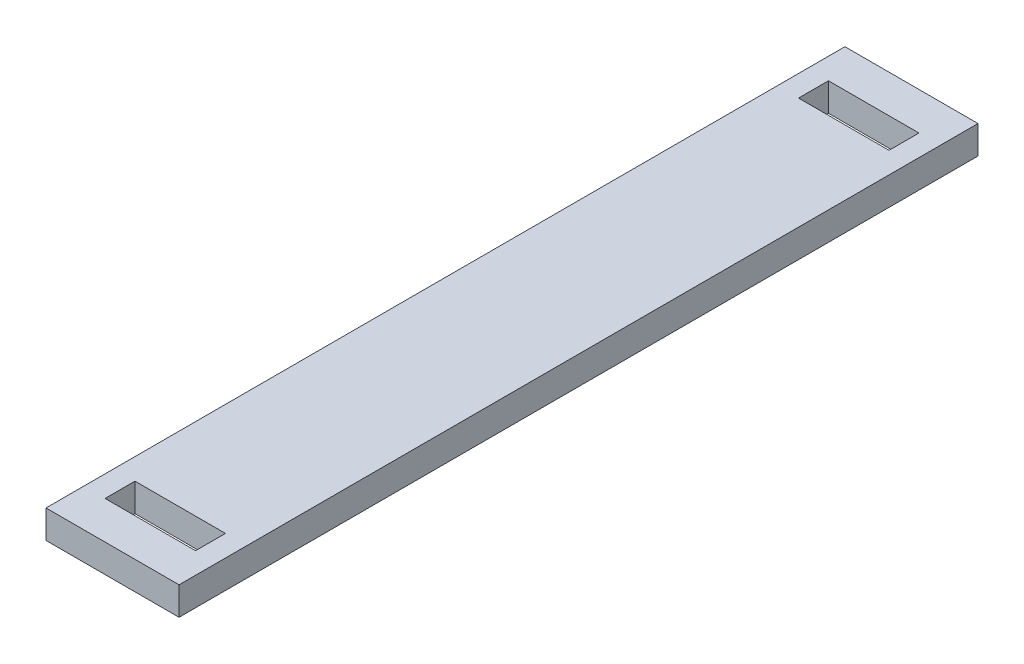
ISO-10303-21;
HEADER;
FILE_DESCRIPTION(('STEP AP214'),'2;1');
FILE_NAME('part.step','',(''),(''),'','','');
FILE_SCHEMA(('AUTOMOTIVE_DESIGN { 1 0 10303 214 1 1 1 1 }'));
ENDSEC;
DATA;
#1=APPLICATION_CONTEXT('core data for automotive mechanical design processes');
#2=APPLICATION_PROTOCOL_DEFINITION('international standard','automotive_design',2000,#1);
#3=PRODUCT_CONTEXT('',#1,'mechanical');
#4=PRODUCT('Part','Part','',(#3));
#5=PRODUCT_RELATED_PRODUCT_CATEGORY('part','',(#4));
#6=PRODUCT_DEFINITION_FORMATION('','',#4);
#7=PRODUCT_DEFINITION_CONTEXT('part definition',#1,'design');
#8=PRODUCT_DEFINITION('design','',#6,#7);
#9=PRODUCT_DEFINITION_SHAPE('','',#8);
#10=(LENGTH_UNIT() NAMED_UNIT(*) SI_UNIT(.MILLI.,.METRE.));
#11=(NAMED_UNIT(*) PLANE_ANGLE_UNIT() SI_UNIT($,.RADIAN.));
#12=(NAMED_UNIT(*) SI_UNIT($,.STERADIAN.) SOLID_ANGLE_UNIT());
#13=UNCERTAINTY_MEASURE_WITH_UNIT(LENGTH_MEASURE(1.E-05),#10,'distance_accuracy_value','');
#14=(GEOMETRIC_REPRESENTATION_CONTEXT(3) GLOBAL_UNCERTAINTY_ASSIGNED_CONTEXT((#13)) GLOBAL_UNIT_ASSIGNED_CONTEXT((#10,
#11,#12)) REPRESENTATION_CONTEXT('',''));
#15=CARTESIAN_POINT('',(0.,0.,0.));
#16=DIRECTION('',(0.,0.,1.));
#17=DIRECTION('',(1.,0.,0.));
#18=AXIS2_PLACEMENT_3D('',#15,#16,#17);
#19=CARTESIAN_POINT('',(-15.,6.35,90.0622));
#20=DIRECTION('',(0.,0.,-1.));
#21=DIRECTION('',(-1.,0.,0.));
#22=AXIS2_PLACEMENT_3D('',#19,#20,#21);
#23=PLANE('',#22);
#24=DIRECTION('',(1.,0.,0.));
#25=VECTOR('',#24,1.);
#26=CARTESIAN_POINT('',(-15.,0.,90.0622));
#27=LINE('',#26,#25);
#28=CARTESIAN_POINT('',(-15.,0.,90.0622));
#29=VERTEX_POINT('',#28);
#30=CARTESIAN_POINT('',(15.,0.,90.0622));
#31=VERTEX_POINT('',#30);
#32=EDGE_CURVE('E183',#29,#31,#27,.T.);
#33=ORIENTED_EDGE('',*,*,#32,.T.);
#34=DIRECTION('',(0.,-1.,0.));
#35=VECTOR('',#34,1.);
#36=CARTESIAN_POINT('',(15.,6.35,90.0622));
#37=LINE('',#36,#35);
#38=CARTESIAN_POINT('',(15.,6.35,90.0622));
#39=VERTEX_POINT('',#38);
#40=EDGE_CURVE('E11',#39,#31,#37,.T.);
#41=ORIENTED_EDGE('',*,*,#40,.F.);
#42=DIRECTION('',(1.,0.,0.));
#43=VECTOR('',#42,1.);
#44=CARTESIAN_POINT('',(-15.,6.35,90.0622));
#45=LINE('',#44,#43);
#46=CARTESIAN_POINT('',(-15.,6.35,90.0622));
#47=VERTEX_POINT('',#46);
#48=EDGE_CURVE('E190',#47,#39,#45,.T.);
#49=ORIENTED_EDGE('',*,*,#48,.F.);
#50=DIRECTION('',(0.,-1.,0.));
#51=VECTOR('',#50,1.);
#52=CARTESIAN_POINT('',(-15.,6.35,90.0622));
#53=LINE('',#52,#51);
#54=EDGE_CURVE('E202',#47,#29,#53,.T.);
#55=ORIENTED_EDGE('',*,*,#54,.T.);
#56=EDGE_LOOP('',(#33,#41,#49,#55));
#57=FACE_BOUND('',#56,.T.);
#58=ADVANCED_FACE('F33',(#57),#23,.F.);
#59=CARTESIAN_POINT('',(15.,6.35,90.0622));
#60=DIRECTION('',(-1.,0.,0.));
#61=DIRECTION('',(0.,0.,1.));
#62=AXIS2_PLACEMENT_3D('',#59,#60,#61);
#63=PLANE('',#62);
#64=DIRECTION('',(0.,0.,-1.));
#65=VECTOR('',#64,1.);
#66=CARTESIAN_POINT('',(15.,0.,90.0622));
#67=LINE('',#66,#65);
#68=CARTESIAN_POINT('',(15.,0.,-90.0622));
#69=VERTEX_POINT('',#68);
#70=EDGE_CURVE('E205',#31,#69,#67,.T.);
#71=ORIENTED_EDGE('',*,*,#70,.T.);
#72=DIRECTION('',(0.,-1.,0.));
#73=VECTOR('',#72,1.);
#74=CARTESIAN_POINT('',(15.,6.35,-90.0622));
#75=LINE('',#74,#73);
#76=CARTESIAN_POINT('',(15.,6.35,-90.0622));
#77=VERTEX_POINT('',#76);
#78=EDGE_CURVE('E40',#77,#69,#75,.T.);
#79=ORIENTED_EDGE('',*,*,#78,.F.);
#80=DIRECTION('',(0.,0.,-1.));
#81=VECTOR('',#80,1.);
#82=CARTESIAN_POINT('',(15.,6.35,90.0622));
#83=LINE('',#82,#81);
#84=EDGE_CURVE('E193',#39,#77,#83,.T.);
#85=ORIENTED_EDGE('',*,*,#84,.F.);
#86=ORIENTED_EDGE('',*,*,#40,.T.);
#87=EDGE_LOOP('',(#71,#79,#85,#86));
#88=FACE_BOUND('',#87,.T.);
#89=ADVANCED_FACE('F221',(#88),#63,.F.);
#90=CARTESIAN_POINT('',(-15.,6.35,-90.0622));
#91=DIRECTION('',(0.,0.,-1.));
#92=DIRECTION('',(-1.,0.,0.));
#93=AXIS2_PLACEMENT_3D('',#90,#91,#92);
#94=PLANE('',#93);
#95=DIRECTION('',(1.,0.,0.));
#96=VECTOR('',#95,1.);
#97=CARTESIAN_POINT('',(-15.,0.,-90.0622));
#98=LINE('',#97,#96);
#99=CARTESIAN_POINT('',(-15.,0.,-90.0622));
#100=VERTEX_POINT('',#99);
#101=EDGE_CURVE('E208',#100,#69,#98,.T.);
#102=ORIENTED_EDGE('',*,*,#101,.F.);
#103=DIRECTION('',(0.,-1.,0.));
#104=VECTOR('',#103,1.);
#105=CARTESIAN_POINT('',(-15.,6.35,-90.0622));
#106=LINE('',#105,#104);
#107=CARTESIAN_POINT('',(-15.,6.35,-90.0622));
#108=VERTEX_POINT('',#107);
#109=EDGE_CURVE('E214',#108,#100,#106,.T.);
#110=ORIENTED_EDGE('',*,*,#109,.F.);
#111=DIRECTION('',(1.,0.,0.));
#112=VECTOR('',#111,1.);
#113=CARTESIAN_POINT('',(-15.,6.35,-90.0622));
#114=LINE('',#113,#112);
#115=EDGE_CURVE('E196',#108,#77,#114,.T.);
#116=ORIENTED_EDGE('',*,*,#115,.T.);
#117=ORIENTED_EDGE('',*,*,#78,.T.);
#118=EDGE_LOOP('',(#102,#110,#116,#117));
#119=FACE_BOUND('',#118,.T.);
#120=ADVANCED_FACE('F218',(#119),#94,.T.);
#121=CARTESIAN_POINT('',(-15.,6.35,90.0622));
#122=DIRECTION('',(-1.,0.,0.));
#123=DIRECTION('',(0.,0.,1.));
#124=AXIS2_PLACEMENT_3D('',#121,#122,#123);
#125=PLANE('',#124);
#126=DIRECTION('',(0.,0.,-1.));
#127=VECTOR('',#126,1.);
#128=CARTESIAN_POINT('',(-15.,0.,90.0622));
#129=LINE('',#128,#127);
#130=EDGE_CURVE('E194',#29,#100,#129,.T.);
#131=ORIENTED_EDGE('',*,*,#130,.F.);
#132=ORIENTED_EDGE('',*,*,#54,.F.);
#133=DIRECTION('',(0.,0.,-1.));
#134=VECTOR('',#133,1.);
#135=CARTESIAN_POINT('',(-15.,6.35,90.0622));
#136=LINE('',#135,#134);
#137=EDGE_CURVE('E199',#47,#108,#136,.T.);
#138=ORIENTED_EDGE('',*,*,#137,.T.);
#139=ORIENTED_EDGE('',*,*,#109,.T.);
#140=EDGE_LOOP('',(#131,#132,#138,#139));
#141=FACE_BOUND('',#140,.T.);
#142=ADVANCED_FACE('F227',(#141),#125,.T.);
#143=CARTESIAN_POINT('',(0.,6.35,0.));
#144=DIRECTION('',(0.,1.,0.));
#145=DIRECTION('',(0.,0.,1.));
#146=AXIS2_PLACEMENT_3D('',#143,#144,#145);
#147=PLANE('',#146);
#148=DIRECTION('',(0.,0.,-1.));
#149=VECTOR('',#148,1.);
#150=CARTESIAN_POINT('',(10.2,6.35,74.8));
#151=LINE('',#150,#149);
#152=CARTESIAN_POINT('',(10.2,6.35,81.55));
#153=VERTEX_POINT('',#152);
#154=CARTESIAN_POINT('',(10.2,6.35,74.8));
#155=VERTEX_POINT('',#154);
#156=EDGE_CURVE('E47',#153,#155,#151,.T.);
#157=ORIENTED_EDGE('',*,*,#156,.F.);
#158=DIRECTION('',(1.,0.,0.));
#159=VECTOR('',#158,1.);
#160=CARTESIAN_POINT('',(-10.2,6.35,81.55));
#161=LINE('',#160,#159);
#162=CARTESIAN_POINT('',(-10.2,6.35,81.55));
#163=VERTEX_POINT('',#162);
#164=EDGE_CURVE('E139',#163,#153,#161,.T.);
#165=ORIENTED_EDGE('',*,*,#164,.F.);
#166=DIRECTION('',(0.,0.,1.));
#167=VECTOR('',#166,1.);
#168=CARTESIAN_POINT('',(-10.2,6.35,74.8));
#169=LINE('',#168,#167);
#170=CARTESIAN_POINT('',(-10.2,6.35,74.8));
#171=VERTEX_POINT('',#170);
#172=EDGE_CURVE('E142',#171,#163,#169,.T.);
#173=ORIENTED_EDGE('',*,*,#172,.F.);
#174=DIRECTION('',(-1.,0.,0.));
#175=VECTOR('',#174,1.);
#176=CARTESIAN_POINT('',(-10.2,6.35,74.8));
#177=LINE('',#176,#175);
#178=EDGE_CURVE('E148',#155,#171,#177,.T.);
#179=ORIENTED_EDGE('',*,*,#178,.F.);
#180=EDGE_LOOP('',(#157,#165,#173,#179));
#181=FACE_BOUND('',#180,.T.);
#182=DIRECTION('',(0.,0.,-1.));
#183=VECTOR('',#182,1.);
#184=CARTESIAN_POINT('',(10.2,6.35,-81.55));
#185=LINE('',#184,#183);
#186=CARTESIAN_POINT('',(10.2,6.35,-74.8));
#187=VERTEX_POINT('',#186);
#188=CARTESIAN_POINT('',(10.2,6.35,-81.55));
#189=VERTEX_POINT('',#188);
#190=EDGE_CURVE('E154',#187,#189,#185,.T.);
#191=ORIENTED_EDGE('',*,*,#190,.F.);
#192=DIRECTION('',(1.,0.,0.));
#193=VECTOR('',#192,1.);
#194=CARTESIAN_POINT('',(-10.2,6.35,-74.8));
#195=LINE('',#194,#193);
#196=CARTESIAN_POINT('',(-10.2,6.35,-74.8));
#197=VERTEX_POINT('',#196);
#198=EDGE_CURVE('E162',#197,#187,#195,.T.);
#199=ORIENTED_EDGE('',*,*,#198,.F.);
#200=DIRECTION('',(0.,0.,1.));
#201=VECTOR('',#200,1.);
#202=CARTESIAN_POINT('',(-10.2,6.35,-81.55));
#203=LINE('',#202,#201);
#204=CARTESIAN_POINT('',(-10.2,6.35,-81.55));
#205=VERTEX_POINT('',#204);
#206=EDGE_CURVE('E176',#205,#197,#203,.T.);
#207=ORIENTED_EDGE('',*,*,#206,.F.);
#208=DIRECTION('',(-1.,0.,0.));
#209=VECTOR('',#208,1.);
#210=CARTESIAN_POINT('',(-10.2,6.35,-81.55));
#211=LINE('',#210,#209);
#212=EDGE_CURVE('E173',#189,#205,#211,.T.);
#213=ORIENTED_EDGE('',*,*,#212,.F.);
#214=EDGE_LOOP('',(#191,#199,#207,#213));
#215=FACE_BOUND('',#214,.T.);
#216=ORIENTED_EDGE('',*,*,#48,.T.);
#217=ORIENTED_EDGE('',*,*,#84,.T.);
#218=ORIENTED_EDGE('',*,*,#115,.F.);
#219=ORIENTED_EDGE('',*,*,#137,.F.);
#220=EDGE_LOOP('',(#216,#217,#218,#219));
#221=FACE_BOUND('',#220,.T.);
#222=ADVANCED_FACE('F231',(#181,#215,#221),#147,.T.);
#223=CARTESIAN_POINT('',(0.,0.,0.));
#224=DIRECTION('',(0.,1.,0.));
#225=DIRECTION('',(0.,0.,1.));
#226=AXIS2_PLACEMENT_3D('',#223,#224,#225);
#227=PLANE('',#226);
#228=DIRECTION('',(1.,0.,0.));
#229=VECTOR('',#228,1.);
#230=CARTESIAN_POINT('',(-10.2,0.,81.55));
#231=LINE('',#230,#229);
#232=CARTESIAN_POINT('',(-10.2,0.,81.55));
#233=VERTEX_POINT('',#232);
#234=CARTESIAN_POINT('',(10.2,0.,81.55));
#235=VERTEX_POINT('',#234);
#236=EDGE_CURVE('E129',#233,#235,#231,.T.);
#237=ORIENTED_EDGE('',*,*,#236,.T.);
#238=DIRECTION('',(0.,0.,-1.));
#239=VECTOR('',#238,1.);
#240=CARTESIAN_POINT('',(10.2,0.,74.8));
#241=LINE('',#240,#239);
#242=CARTESIAN_POINT('',(10.2,0.,74.8));
#243=VERTEX_POINT('',#242);
#244=EDGE_CURVE('E123',#235,#243,#241,.T.);
#245=ORIENTED_EDGE('',*,*,#244,.T.);
#246=DIRECTION('',(-1.,0.,0.));
#247=VECTOR('',#246,1.);
#248=CARTESIAN_POINT('',(-10.2,0.,74.8));
#249=LINE('',#248,#247);
#250=CARTESIAN_POINT('',(-10.2,0.,74.8));
#251=VERTEX_POINT('',#250);
#252=EDGE_CURVE('E132',#243,#251,#249,.T.);
#253=ORIENTED_EDGE('',*,*,#252,.T.);
#254=DIRECTION('',(0.,0.,1.));
#255=VECTOR('',#254,1.);
#256=CARTESIAN_POINT('',(-10.2,0.,74.8));
#257=LINE('',#256,#255);
#258=EDGE_CURVE('E55',#251,#233,#257,.T.);
#259=ORIENTED_EDGE('',*,*,#258,.T.);
#260=EDGE_LOOP('',(#237,#245,#253,#259));
#261=FACE_BOUND('',#260,.T.);
#262=DIRECTION('',(1.,0.,0.));
#263=VECTOR('',#262,1.);
#264=CARTESIAN_POINT('',(-10.2,0.,-74.8));
#265=LINE('',#264,#263);
#266=CARTESIAN_POINT('',(-10.2,0.,-74.8));
#267=VERTEX_POINT('',#266);
#268=CARTESIAN_POINT('',(10.2,0.,-74.8));
#269=VERTEX_POINT('',#268);
#270=EDGE_CURVE('E168',#267,#269,#265,.T.);
#271=ORIENTED_EDGE('',*,*,#270,.T.);
#272=DIRECTION('',(0.,0.,-1.));
#273=VECTOR('',#272,1.);
#274=CARTESIAN_POINT('',(10.2,0.,-81.55));
#275=LINE('',#274,#273);
#276=CARTESIAN_POINT('',(10.2,0.,-81.55));
#277=VERTEX_POINT('',#276);
#278=EDGE_CURVE('E158',#269,#277,#275,.T.);
#279=ORIENTED_EDGE('',*,*,#278,.T.);
#280=DIRECTION('',(-1.,0.,0.));
#281=VECTOR('',#280,1.);
#282=CARTESIAN_POINT('',(-10.2,0.,-81.55));
#283=LINE('',#282,#281);
#284=CARTESIAN_POINT('',(-10.2,0.,-81.55));
#285=VERTEX_POINT('',#284);
#286=EDGE_CURVE('E161',#277,#285,#283,.T.);
#287=ORIENTED_EDGE('',*,*,#286,.T.);
#288=DIRECTION('',(0.,0.,1.));
#289=VECTOR('',#288,1.);
#290=CARTESIAN_POINT('',(-10.2,0.,-81.55));
#291=LINE('',#290,#289);
#292=EDGE_CURVE('E165',#285,#267,#291,.T.);
#293=ORIENTED_EDGE('',*,*,#292,.T.);
#294=EDGE_LOOP('',(#271,#279,#287,#293));
#295=FACE_BOUND('',#294,.T.);
#296=ORIENTED_EDGE('',*,*,#32,.F.);
#297=ORIENTED_EDGE('',*,*,#130,.T.);
#298=ORIENTED_EDGE('',*,*,#101,.T.);
#299=ORIENTED_EDGE('',*,*,#70,.F.);
#300=EDGE_LOOP('',(#296,#297,#298,#299));
#301=FACE_BOUND('',#300,.T.);
#302=ADVANCED_FACE('F136',(#261,#295,#301),#227,.F.);
#303=CARTESIAN_POINT('',(10.2,0.,-81.55));
#304=DIRECTION('',(1.,0.,0.));
#305=DIRECTION('',(0.,0.,-1.));
#306=AXIS2_PLACEMENT_3D('',#303,#304,#305);
#307=PLANE('',#306);
#308=ORIENTED_EDGE('',*,*,#190,.T.);
#309=DIRECTION('',(0.,1.,0.));
#310=VECTOR('',#309,1.);
#311=CARTESIAN_POINT('',(10.2,0.,-81.55));
#312=LINE('',#311,#310);
#313=EDGE_CURVE('E171',#277,#189,#312,.T.);
#314=ORIENTED_EDGE('',*,*,#313,.F.);
#315=ORIENTED_EDGE('',*,*,#278,.F.);
#316=DIRECTION('',(0.,1.,0.));
#317=VECTOR('',#316,1.);
#318=CARTESIAN_POINT('',(10.2,0.,-74.8));
#319=LINE('',#318,#317);
#320=EDGE_CURVE('E181',#269,#187,#319,.T.);
#321=ORIENTED_EDGE('',*,*,#320,.T.);
#322=EDGE_LOOP('',(#308,#314,#315,#321));
#323=FACE_BOUND('',#322,.T.);
#324=ADVANCED_FACE('F246',(#323),#307,.F.);
#325=CARTESIAN_POINT('',(-10.2,0.,-74.8));
#326=DIRECTION('',(0.,0.,1.));
#327=DIRECTION('',(1.,0.,0.));
#328=AXIS2_PLACEMENT_3D('',#325,#326,#327);
#329=PLANE('',#328);
#330=ORIENTED_EDGE('',*,*,#198,.T.);
#331=ORIENTED_EDGE('',*,*,#320,.F.);
#332=ORIENTED_EDGE('',*,*,#270,.F.);
#333=DIRECTION('',(0.,1.,0.));
#334=VECTOR('',#333,1.);
#335=CARTESIAN_POINT('',(-10.2,0.,-74.8));
#336=LINE('',#335,#334);
#337=EDGE_CURVE('E184',#267,#197,#336,.T.);
#338=ORIENTED_EDGE('',*,*,#337,.T.);
#339=EDGE_LOOP('',(#330,#331,#332,#338));
#340=FACE_BOUND('',#339,.T.);
#341=ADVANCED_FACE('F252',(#340),#329,.F.);
#342=CARTESIAN_POINT('',(-10.2,0.,-81.55));
#343=DIRECTION('',(-1.,0.,0.));
#344=DIRECTION('',(0.,0.,1.));
#345=AXIS2_PLACEMENT_3D('',#342,#343,#344);
#346=PLANE('',#345);
#347=ORIENTED_EDGE('',*,*,#206,.T.);
#348=ORIENTED_EDGE('',*,*,#337,.F.);
#349=ORIENTED_EDGE('',*,*,#292,.F.);
#350=DIRECTION('',(0.,1.,0.));
#351=VECTOR('',#350,1.);
#352=CARTESIAN_POINT('',(-10.2,0.,-81.55));
#353=LINE('',#352,#351);
#354=EDGE_CURVE('E186',#285,#205,#353,.T.);
#355=ORIENTED_EDGE('',*,*,#354,.T.);
#356=EDGE_LOOP('',(#347,#348,#349,#355));
#357=FACE_BOUND('',#356,.T.);
#358=ADVANCED_FACE('F257',(#357),#346,.F.);
#359=CARTESIAN_POINT('',(-10.2,0.,-81.55));
#360=DIRECTION('',(0.,0.,-1.));
#361=DIRECTION('',(-1.,0.,0.));
#362=AXIS2_PLACEMENT_3D('',#359,#360,#361);
#363=PLANE('',#362);
#364=ORIENTED_EDGE('',*,*,#212,.T.);
#365=ORIENTED_EDGE('',*,*,#354,.F.);
#366=ORIENTED_EDGE('',*,*,#286,.F.);
#367=ORIENTED_EDGE('',*,*,#313,.T.);
#368=EDGE_LOOP('',(#364,#365,#366,#367));
#369=FACE_BOUND('',#368,.T.);
#370=ADVANCED_FACE('F254',(#369),#363,.F.);
#371=CARTESIAN_POINT('',(10.2,0.,74.8));
#372=DIRECTION('',(1.,0.,0.));
#373=DIRECTION('',(0.,0.,-1.));
#374=AXIS2_PLACEMENT_3D('',#371,#372,#373);
#375=PLANE('',#374);
#376=ORIENTED_EDGE('',*,*,#156,.T.);
#377=DIRECTION('',(0.,1.,0.));
#378=VECTOR('',#377,1.);
#379=CARTESIAN_POINT('',(10.2,0.,74.8));
#380=LINE('',#379,#378);
#381=EDGE_CURVE('E119',#243,#155,#380,.T.);
#382=ORIENTED_EDGE('',*,*,#381,.F.);
#383=ORIENTED_EDGE('',*,*,#244,.F.);
#384=DIRECTION('',(0.,1.,0.));
#385=VECTOR('',#384,1.);
#386=CARTESIAN_POINT('',(10.2,0.,81.55));
#387=LINE('',#386,#385);
#388=EDGE_CURVE('E152',#235,#153,#387,.T.);
#389=ORIENTED_EDGE('',*,*,#388,.T.);
#390=EDGE_LOOP('',(#376,#382,#383,#389));
#391=FACE_BOUND('',#390,.T.);
#392=ADVANCED_FACE('F121',(#391),#375,.F.);
#393=CARTESIAN_POINT('',(-10.2,0.,81.55));
#394=DIRECTION('',(0.,0.,1.));
#395=DIRECTION('',(1.,0.,0.));
#396=AXIS2_PLACEMENT_3D('',#393,#394,#395);
#397=PLANE('',#396);
#398=ORIENTED_EDGE('',*,*,#164,.T.);
#399=ORIENTED_EDGE('',*,*,#388,.F.);
#400=ORIENTED_EDGE('',*,*,#236,.F.);
#401=DIRECTION('',(0.,1.,0.));
#402=VECTOR('',#401,1.);
#403=CARTESIAN_POINT('',(-10.2,0.,81.55));
#404=LINE('',#403,#402);
#405=EDGE_CURVE('E155',#233,#163,#404,.T.);
#406=ORIENTED_EDGE('',*,*,#405,.T.);
#407=EDGE_LOOP('',(#398,#399,#400,#406));
#408=FACE_BOUND('',#407,.T.);
#409=ADVANCED_FACE('F267',(#408),#397,.F.);
#410=CARTESIAN_POINT('',(-10.2,0.,74.8));
#411=DIRECTION('',(-1.,0.,0.));
#412=DIRECTION('',(0.,0.,1.));
#413=AXIS2_PLACEMENT_3D('',#410,#411,#412);
#414=PLANE('',#413);
#415=ORIENTED_EDGE('',*,*,#172,.T.);
#416=ORIENTED_EDGE('',*,*,#405,.F.);
#417=ORIENTED_EDGE('',*,*,#258,.F.);
#418=DIRECTION('',(0.,1.,0.));
#419=VECTOR('',#418,1.);
#420=CARTESIAN_POINT('',(-10.2,0.,74.8));
#421=LINE('',#420,#419);
#422=EDGE_CURVE('E128',#251,#171,#421,.T.);
#423=ORIENTED_EDGE('',*,*,#422,.T.);
#424=EDGE_LOOP('',(#415,#416,#417,#423));
#425=FACE_BOUND('',#424,.T.);
#426=ADVANCED_FACE('F270',(#425),#414,.F.);
#427=CARTESIAN_POINT('',(-10.2,0.,74.8));
#428=DIRECTION('',(0.,0.,-1.));
#429=DIRECTION('',(-1.,0.,0.));
#430=AXIS2_PLACEMENT_3D('',#427,#428,#429);
#431=PLANE('',#430);
#432=ORIENTED_EDGE('',*,*,#178,.T.);
#433=ORIENTED_EDGE('',*,*,#422,.F.);
#434=ORIENTED_EDGE('',*,*,#252,.F.);
#435=ORIENTED_EDGE('',*,*,#381,.T.);
#436=EDGE_LOOP('',(#432,#433,#434,#435));
#437=FACE_BOUND('',#436,.T.);
#438=ADVANCED_FACE('F133',(#437),#431,.F.);
#439=CLOSED_SHELL('',(#58,#89,#120,#142,#222,#302,#324,#341,#358,#370,#392,#409,#426,#438));
#440=MANIFOLD_SOLID_BREP('B2',#439);
#441=ADVANCED_BREP_SHAPE_REPRESENTATION('',(#18,#440),#14);
#442=SHAPE_DEFINITION_REPRESENTATION(#9,#441);
ENDSEC;
END-ISO-10303-21;
